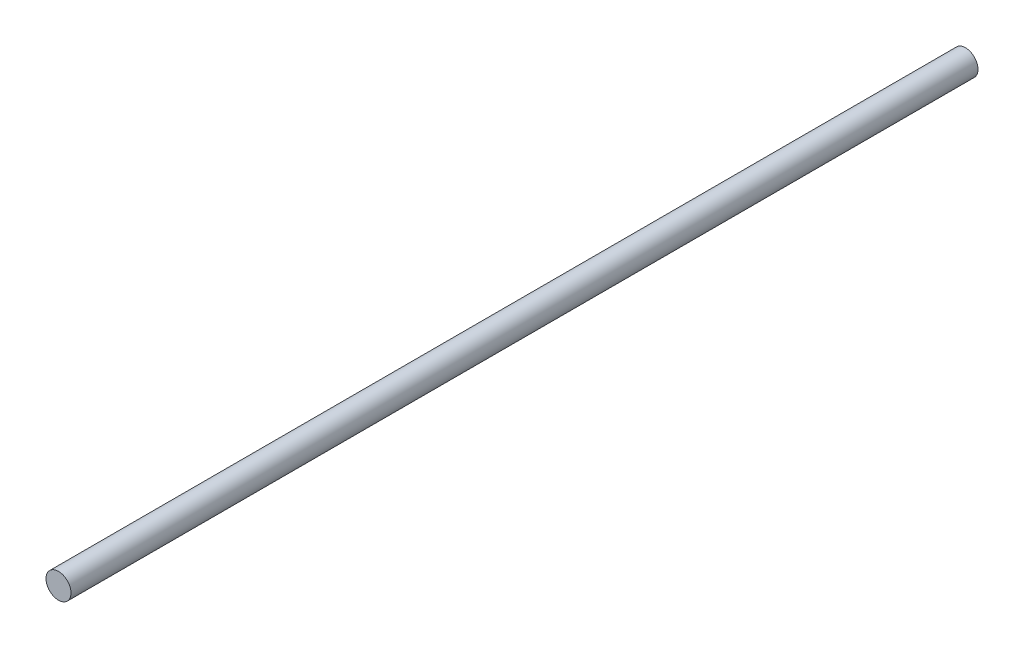
ISO-10303-21;
HEADER;
FILE_DESCRIPTION(('STEP AP214'),'2;1');
FILE_NAME('part.step','',(''),(''),'','','');
FILE_SCHEMA(('AUTOMOTIVE_DESIGN { 1 0 10303 214 1 1 1 1 }'));
ENDSEC;
DATA;
#1=APPLICATION_CONTEXT('core data for automotive mechanical design processes');
#2=APPLICATION_PROTOCOL_DEFINITION('international standard','automotive_design',2000,#1);
#3=PRODUCT_CONTEXT('',#1,'mechanical');
#4=PRODUCT('Part','Part','',(#3));
#5=PRODUCT_RELATED_PRODUCT_CATEGORY('part','',(#4));
#6=PRODUCT_DEFINITION_FORMATION('','',#4);
#7=PRODUCT_DEFINITION_CONTEXT('part definition',#1,'design');
#8=PRODUCT_DEFINITION('design','',#6,#7);
#9=PRODUCT_DEFINITION_SHAPE('','',#8);
#10=(LENGTH_UNIT() NAMED_UNIT(*) SI_UNIT(.MILLI.,.METRE.));
#11=(NAMED_UNIT(*) PLANE_ANGLE_UNIT() SI_UNIT($,.RADIAN.));
#12=(NAMED_UNIT(*) SI_UNIT($,.STERADIAN.) SOLID_ANGLE_UNIT());
#13=UNCERTAINTY_MEASURE_WITH_UNIT(LENGTH_MEASURE(1.E-05),#10,'distance_accuracy_value','');
#14=(GEOMETRIC_REPRESENTATION_CONTEXT(3) GLOBAL_UNCERTAINTY_ASSIGNED_CONTEXT((#13)) GLOBAL_UNIT_ASSIGNED_CONTEXT((#10,
#11,#12)) REPRESENTATION_CONTEXT('',''));
#15=CARTESIAN_POINT('',(0.,0.,0.));
#16=DIRECTION('',(0.,0.,1.));
#17=DIRECTION('',(1.,0.,0.));
#18=AXIS2_PLACEMENT_3D('',#15,#16,#17);
#19=CARTESIAN_POINT('',(0.,0.,290.));
#20=DIRECTION('',(0.,0.,-1.));
#21=DIRECTION('',(-1.,0.,0.));
#22=AXIS2_PLACEMENT_3D('',#19,#20,#21);
#23=CYLINDRICAL_SURFACE('',#22,4.);
#24=CARTESIAN_POINT('',(0.,0.,290.));
#25=DIRECTION('',(0.,0.,1.));
#26=DIRECTION('',(1.,0.,0.));
#27=AXIS2_PLACEMENT_3D('',#24,#25,#26);
#28=CIRCLE('',#27,4.);
#29=CARTESIAN_POINT('',(4.,0.,290.));
#30=VERTEX_POINT('',#29);
#31=EDGE_CURVE('E10',#30,#30,#28,.T.);
#32=ORIENTED_EDGE('',*,*,#31,.F.);
#33=EDGE_LOOP('',(#32));
#34=FACE_BOUND('',#33,.T.);
#35=CARTESIAN_POINT('',(0.,0.,0.));
#36=DIRECTION('',(0.,0.,1.));
#37=DIRECTION('',(1.,0.,0.));
#38=AXIS2_PLACEMENT_3D('',#35,#36,#37);
#39=CIRCLE('',#38,4.);
#40=CARTESIAN_POINT('',(4.,0.,0.));
#41=VERTEX_POINT('',#40);
#42=EDGE_CURVE('E44',#41,#41,#39,.T.);
#43=ORIENTED_EDGE('',*,*,#42,.T.);
#44=EDGE_LOOP('',(#43));
#45=FACE_BOUND('',#44,.T.);
#46=ADVANCED_FACE('F41',(#34,#45),#23,.T.);
#47=CARTESIAN_POINT('',(0.,0.,290.));
#48=DIRECTION('',(0.,0.,1.));
#49=DIRECTION('',(1.,0.,0.));
#50=AXIS2_PLACEMENT_3D('',#47,#48,#49);
#51=PLANE('',#50);
#52=ORIENTED_EDGE('',*,*,#31,.T.);
#53=EDGE_LOOP('',(#52));
#54=FACE_BOUND('',#53,.T.);
#55=ADVANCED_FACE('F56',(#54),#51,.T.);
#56=CARTESIAN_POINT('',(0.,0.,0.));
#57=DIRECTION('',(0.,0.,1.));
#58=DIRECTION('',(1.,0.,0.));
#59=AXIS2_PLACEMENT_3D('',#56,#57,#58);
#60=PLANE('',#59);
#61=ORIENTED_EDGE('',*,*,#42,.F.);
#62=EDGE_LOOP('',(#61));
#63=FACE_BOUND('',#62,.T.);
#64=ADVANCED_FACE('F54',(#63),#60,.F.);
#65=CLOSED_SHELL('',(#46,#55,#64));
#66=MANIFOLD_SOLID_BREP('B2',#65);
#67=ADVANCED_BREP_SHAPE_REPRESENTATION('',(#18,#66),#14);
#68=SHAPE_DEFINITION_REPRESENTATION(#9,#67);
ENDSEC;
END-ISO-10303-21;
